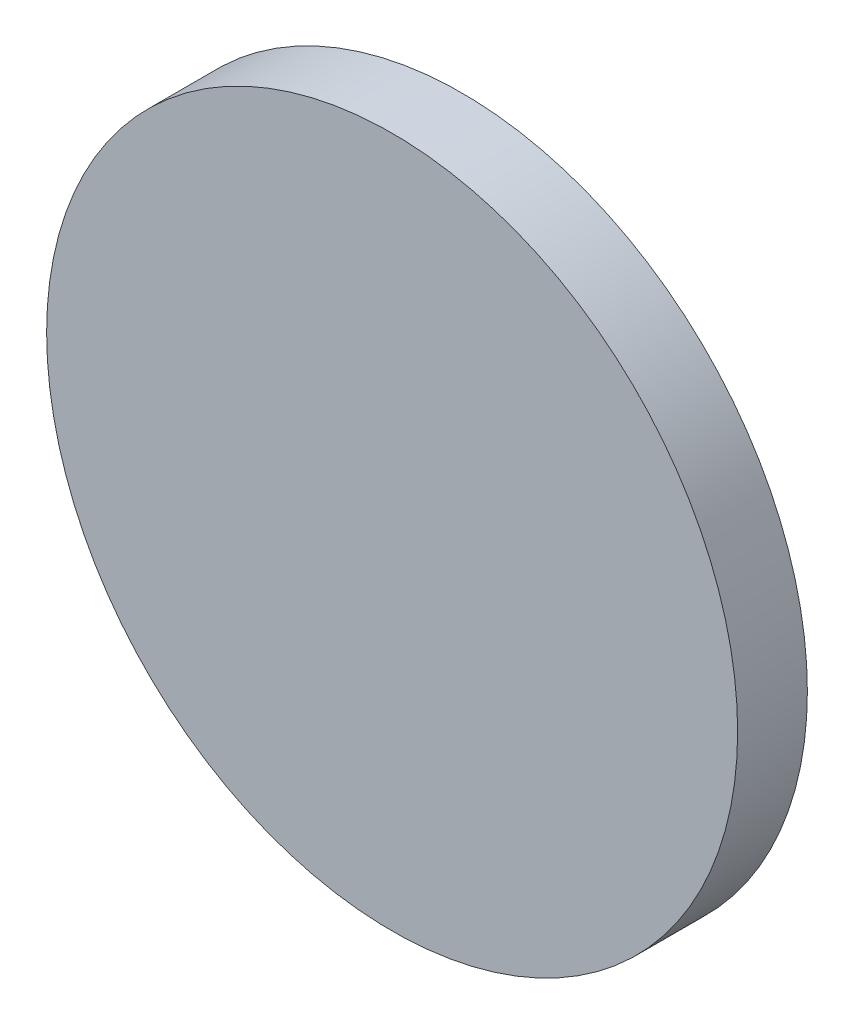
ISO-10303-21;
HEADER;
FILE_DESCRIPTION(('STEP AP214'),'2;1');
FILE_NAME('part.step','',(''),(''),'','','');
FILE_SCHEMA(('AUTOMOTIVE_DESIGN { 1 0 10303 214 1 1 1 1 }'));
ENDSEC;
DATA;
#1=APPLICATION_CONTEXT('core data for automotive mechanical design processes');
#2=APPLICATION_PROTOCOL_DEFINITION('international standard','automotive_design',2000,#1);
#3=PRODUCT_CONTEXT('',#1,'mechanical');
#4=PRODUCT('Part','Part','',(#3));
#5=PRODUCT_RELATED_PRODUCT_CATEGORY('part','',(#4));
#6=PRODUCT_DEFINITION_FORMATION('','',#4);
#7=PRODUCT_DEFINITION_CONTEXT('part definition',#1,'design');
#8=PRODUCT_DEFINITION('design','',#6,#7);
#9=PRODUCT_DEFINITION_SHAPE('','',#8);
#10=(LENGTH_UNIT() NAMED_UNIT(*) SI_UNIT(.MILLI.,.METRE.));
#11=(NAMED_UNIT(*) PLANE_ANGLE_UNIT() SI_UNIT($,.RADIAN.));
#12=(NAMED_UNIT(*) SI_UNIT($,.STERADIAN.) SOLID_ANGLE_UNIT());
#13=UNCERTAINTY_MEASURE_WITH_UNIT(LENGTH_MEASURE(1.E-05),#10,'distance_accuracy_value','');
#14=(GEOMETRIC_REPRESENTATION_CONTEXT(3) GLOBAL_UNCERTAINTY_ASSIGNED_CONTEXT((#13)) GLOBAL_UNIT_ASSIGNED_CONTEXT((#10,
#11,#12)) REPRESENTATION_CONTEXT('',''));
#15=CARTESIAN_POINT('',(0.,0.,0.));
#16=DIRECTION('',(0.,0.,1.));
#17=DIRECTION('',(1.,0.,0.));
#18=AXIS2_PLACEMENT_3D('',#15,#16,#17);
#19=CARTESIAN_POINT('',(0.,0.,5.715));
#20=DIRECTION('',(0.,0.,-1.));
#21=DIRECTION('',(-1.,0.,0.));
#22=AXIS2_PLACEMENT_3D('',#19,#20,#21);
#23=CYLINDRICAL_SURFACE('',#22,28.321);
#24=CARTESIAN_POINT('',(0.,0.,5.715));
#25=DIRECTION('',(0.,0.,1.));
#26=DIRECTION('',(1.,0.,0.));
#27=AXIS2_PLACEMENT_3D('',#24,#25,#26);
#28=CIRCLE('',#27,28.321);
#29=CARTESIAN_POINT('',(28.321,0.,5.715));
#30=VERTEX_POINT('',#29);
#31=EDGE_CURVE('E10',#30,#30,#28,.T.);
#32=ORIENTED_EDGE('',*,*,#31,.F.);
#33=EDGE_LOOP('',(#32));
#34=FACE_BOUND('',#33,.T.);
#35=CARTESIAN_POINT('',(0.,0.,0.));
#36=DIRECTION('',(0.,0.,1.));
#37=DIRECTION('',(1.,0.,0.));
#38=AXIS2_PLACEMENT_3D('',#35,#36,#37);
#39=CIRCLE('',#38,28.321);
#40=CARTESIAN_POINT('',(28.321,0.,0.));
#41=VERTEX_POINT('',#40);
#42=EDGE_CURVE('E35',#41,#41,#39,.T.);
#43=ORIENTED_EDGE('',*,*,#42,.T.);
#44=EDGE_LOOP('',(#43));
#45=FACE_BOUND('',#44,.T.);
#46=ADVANCED_FACE('F32',(#34,#45),#23,.T.);
#47=CARTESIAN_POINT('',(0.,0.,5.715));
#48=DIRECTION('',(0.,0.,1.));
#49=DIRECTION('',(1.,0.,0.));
#50=AXIS2_PLACEMENT_3D('',#47,#48,#49);
#51=PLANE('',#50);
#52=ORIENTED_EDGE('',*,*,#31,.T.);
#53=EDGE_LOOP('',(#52));
#54=FACE_BOUND('',#53,.T.);
#55=ADVANCED_FACE('F47',(#54),#51,.T.);
#56=CARTESIAN_POINT('',(0.,0.,0.));
#57=DIRECTION('',(0.,0.,1.));
#58=DIRECTION('',(1.,0.,0.));
#59=AXIS2_PLACEMENT_3D('',#56,#57,#58);
#60=PLANE('',#59);
#61=ORIENTED_EDGE('',*,*,#42,.F.);
#62=EDGE_LOOP('',(#61));
#63=FACE_BOUND('',#62,.T.);
#64=ADVANCED_FACE('F45',(#63),#60,.F.);
#65=CLOSED_SHELL('',(#46,#55,#64));
#66=MANIFOLD_SOLID_BREP('B2',#65);
#67=ADVANCED_BREP_SHAPE_REPRESENTATION('',(#18,#66),#14);
#68=SHAPE_DEFINITION_REPRESENTATION(#9,#67);
ENDSEC;
END-ISO-10303-21;
